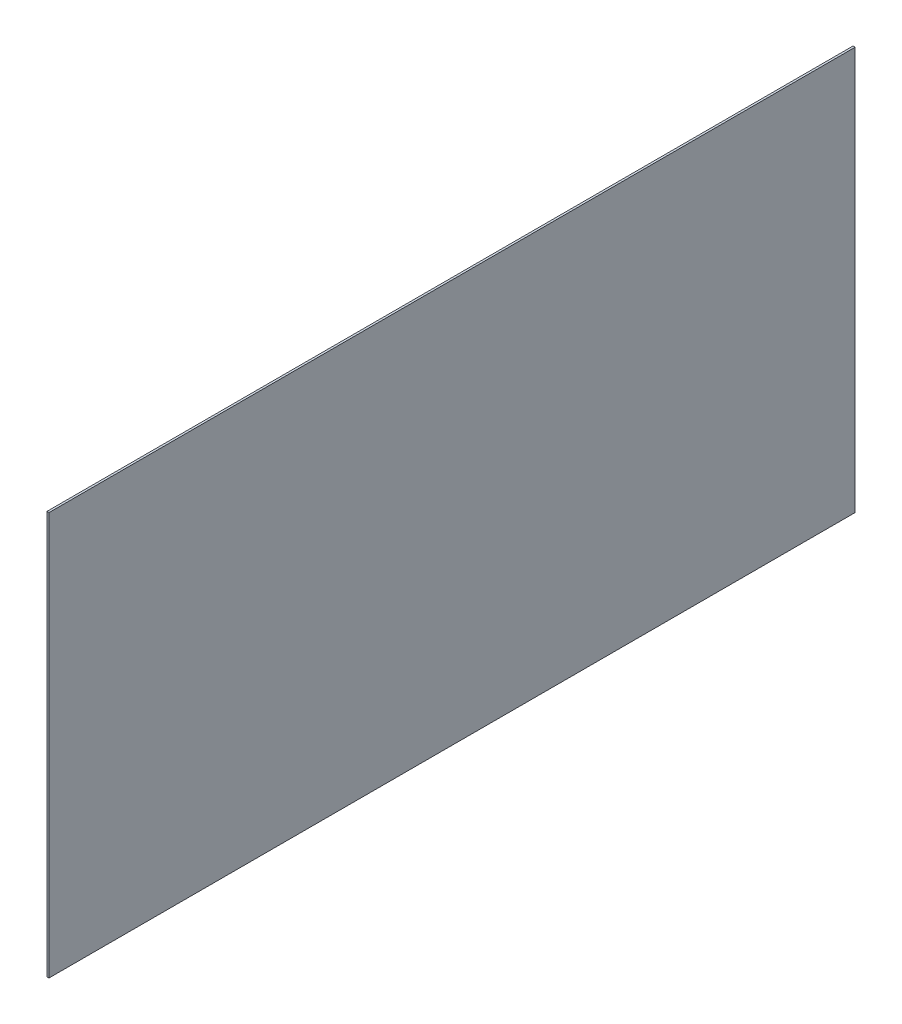
ISO-10303-21;
HEADER;
FILE_DESCRIPTION(('STEP AP214'),'2;1');
FILE_NAME('part.step','',(''),(''),'','','');
FILE_SCHEMA(('AUTOMOTIVE_DESIGN { 1 0 10303 214 1 1 1 1 }'));
ENDSEC;
DATA;
#1=APPLICATION_CONTEXT('core data for automotive mechanical design processes');
#2=APPLICATION_PROTOCOL_DEFINITION('international standard','automotive_design',2000,#1);
#3=PRODUCT_CONTEXT('',#1,'mechanical');
#4=PRODUCT('Part','Part','',(#3));
#5=PRODUCT_RELATED_PRODUCT_CATEGORY('part','',(#4));
#6=PRODUCT_DEFINITION_FORMATION('','',#4);
#7=PRODUCT_DEFINITION_CONTEXT('part definition',#1,'design');
#8=PRODUCT_DEFINITION('design','',#6,#7);
#9=PRODUCT_DEFINITION_SHAPE('','',#8);
#10=(LENGTH_UNIT() NAMED_UNIT(*) SI_UNIT(.MILLI.,.METRE.));
#11=(NAMED_UNIT(*) PLANE_ANGLE_UNIT() SI_UNIT($,.RADIAN.));
#12=(NAMED_UNIT(*) SI_UNIT($,.STERADIAN.) SOLID_ANGLE_UNIT());
#13=UNCERTAINTY_MEASURE_WITH_UNIT(LENGTH_MEASURE(1.E-05),#10,'distance_accuracy_value','');
#14=(GEOMETRIC_REPRESENTATION_CONTEXT(3) GLOBAL_UNCERTAINTY_ASSIGNED_CONTEXT((#13)) GLOBAL_UNIT_ASSIGNED_CONTEXT((#10,
#11,#12)) REPRESENTATION_CONTEXT('',''));
#15=CARTESIAN_POINT('',(0.,0.,0.));
#16=DIRECTION('',(0.,0.,1.));
#17=DIRECTION('',(1.,0.,0.));
#18=AXIS2_PLACEMENT_3D('',#15,#16,#17);
#19=CARTESIAN_POINT('',(4.7625,0.,0.));
#20=DIRECTION('',(0.,0.,-1.));
#21=DIRECTION('',(-1.,0.,0.));
#22=AXIS2_PLACEMENT_3D('',#19,#20,#21);
#23=PLANE('',#22);
#24=DIRECTION('',(0.,-1.,0.));
#25=VECTOR('',#24,1.);
#26=CARTESIAN_POINT('',(0.,0.,0.));
#27=LINE('',#26,#25);
#28=CARTESIAN_POINT('',(0.,914.4,0.));
#29=VERTEX_POINT('',#28);
#30=CARTESIAN_POINT('',(0.,0.,0.));
#31=VERTEX_POINT('',#30);
#32=EDGE_CURVE('E106',#29,#31,#27,.T.);
#33=ORIENTED_EDGE('',*,*,#32,.T.);
#34=DIRECTION('',(-1.,0.,0.));
#35=VECTOR('',#34,1.);
#36=CARTESIAN_POINT('',(4.7625,0.,0.));
#37=LINE('',#36,#35);
#38=CARTESIAN_POINT('',(4.7625,0.,0.));
#39=VERTEX_POINT('',#38);
#40=EDGE_CURVE('E11',#39,#31,#37,.T.);
#41=ORIENTED_EDGE('',*,*,#40,.F.);
#42=DIRECTION('',(0.,-1.,0.));
#43=VECTOR('',#42,1.);
#44=CARTESIAN_POINT('',(4.7625,0.,0.));
#45=LINE('',#44,#43);
#46=CARTESIAN_POINT('',(4.7625,914.4,0.));
#47=VERTEX_POINT('',#46);
#48=EDGE_CURVE('E94',#47,#39,#45,.T.);
#49=ORIENTED_EDGE('',*,*,#48,.F.);
#50=DIRECTION('',(-1.,0.,0.));
#51=VECTOR('',#50,1.);
#52=CARTESIAN_POINT('',(4.7625,914.4,0.));
#53=LINE('',#52,#51);
#54=EDGE_CURVE('E102',#47,#29,#53,.T.);
#55=ORIENTED_EDGE('',*,*,#54,.T.);
#56=EDGE_LOOP('',(#33,#41,#49,#55));
#57=FACE_BOUND('',#56,.T.);
#58=ADVANCED_FACE('F43',(#57),#23,.F.);
#59=CARTESIAN_POINT('',(4.7625,0.,0.));
#60=DIRECTION('',(0.,1.,0.));
#61=DIRECTION('',(0.,0.,1.));
#62=AXIS2_PLACEMENT_3D('',#59,#60,#61);
#63=PLANE('',#62);
#64=DIRECTION('',(0.,0.,-1.));
#65=VECTOR('',#64,1.);
#66=CARTESIAN_POINT('',(0.,0.,0.));
#67=LINE('',#66,#65);
#68=CARTESIAN_POINT('',(0.,0.,-1828.8));
#69=VERTEX_POINT('',#68);
#70=EDGE_CURVE('E98',#31,#69,#67,.T.);
#71=ORIENTED_EDGE('',*,*,#70,.T.);
#72=DIRECTION('',(-1.,0.,0.));
#73=VECTOR('',#72,1.);
#74=CARTESIAN_POINT('',(4.7625,0.,-1828.8));
#75=LINE('',#74,#73);
#76=CARTESIAN_POINT('',(4.7625,0.,-1828.8));
#77=VERTEX_POINT('',#76);
#78=EDGE_CURVE('E51',#77,#69,#75,.T.);
#79=ORIENTED_EDGE('',*,*,#78,.F.);
#80=DIRECTION('',(0.,0.,-1.));
#81=VECTOR('',#80,1.);
#82=CARTESIAN_POINT('',(4.7625,0.,0.));
#83=LINE('',#82,#81);
#84=EDGE_CURVE('E89',#39,#77,#83,.T.);
#85=ORIENTED_EDGE('',*,*,#84,.F.);
#86=ORIENTED_EDGE('',*,*,#40,.T.);
#87=EDGE_LOOP('',(#71,#79,#85,#86));
#88=FACE_BOUND('',#87,.T.);
#89=ADVANCED_FACE('F97',(#88),#63,.F.);
#90=CARTESIAN_POINT('',(4.7625,0.,-1828.8));
#91=DIRECTION('',(0.,0.,1.));
#92=DIRECTION('',(1.,0.,0.));
#93=AXIS2_PLACEMENT_3D('',#90,#91,#92);
#94=PLANE('',#93);
#95=DIRECTION('',(0.,1.,0.));
#96=VECTOR('',#95,1.);
#97=CARTESIAN_POINT('',(0.,0.,-1828.8));
#98=LINE('',#97,#96);
#99=CARTESIAN_POINT('',(0.,914.4,-1828.8));
#100=VERTEX_POINT('',#99);
#101=EDGE_CURVE('E76',#69,#100,#98,.T.);
#102=ORIENTED_EDGE('',*,*,#101,.T.);
#103=DIRECTION('',(-1.,0.,0.));
#104=VECTOR('',#103,1.);
#105=CARTESIAN_POINT('',(4.7625,914.4,-1828.8));
#106=LINE('',#105,#104);
#107=CARTESIAN_POINT('',(4.7625,914.4,-1828.8));
#108=VERTEX_POINT('',#107);
#109=EDGE_CURVE('E99',#108,#100,#106,.T.);
#110=ORIENTED_EDGE('',*,*,#109,.F.);
#111=DIRECTION('',(0.,1.,0.));
#112=VECTOR('',#111,1.);
#113=CARTESIAN_POINT('',(4.7625,0.,-1828.8));
#114=LINE('',#113,#112);
#115=EDGE_CURVE('E92',#77,#108,#114,.T.);
#116=ORIENTED_EDGE('',*,*,#115,.F.);
#117=ORIENTED_EDGE('',*,*,#78,.T.);
#118=EDGE_LOOP('',(#102,#110,#116,#117));
#119=FACE_BOUND('',#118,.T.);
#120=ADVANCED_FACE('F100',(#119),#94,.F.);
#121=CARTESIAN_POINT('',(4.7625,914.4,0.));
#122=DIRECTION('',(0.,-1.,0.));
#123=DIRECTION('',(0.,0.,-1.));
#124=AXIS2_PLACEMENT_3D('',#121,#122,#123);
#125=PLANE('',#124);
#126=DIRECTION('',(0.,0.,1.));
#127=VECTOR('',#126,1.);
#128=CARTESIAN_POINT('',(0.,914.4,0.));
#129=LINE('',#128,#127);
#130=EDGE_CURVE('E82',#100,#29,#129,.T.);
#131=ORIENTED_EDGE('',*,*,#130,.T.);
#132=ORIENTED_EDGE('',*,*,#54,.F.);
#133=DIRECTION('',(0.,0.,1.));
#134=VECTOR('',#133,1.);
#135=CARTESIAN_POINT('',(4.7625,914.4,0.));
#136=LINE('',#135,#134);
#137=EDGE_CURVE('E59',#108,#47,#136,.T.);
#138=ORIENTED_EDGE('',*,*,#137,.F.);
#139=ORIENTED_EDGE('',*,*,#109,.T.);
#140=EDGE_LOOP('',(#131,#132,#138,#139));
#141=FACE_BOUND('',#140,.T.);
#142=ADVANCED_FACE('F113',(#141),#125,.F.);
#143=CARTESIAN_POINT('',(4.7625,0.,0.));
#144=DIRECTION('',(-1.,0.,0.));
#145=DIRECTION('',(0.,0.,1.));
#146=AXIS2_PLACEMENT_3D('',#143,#144,#145);
#147=PLANE('',#146);
#148=ORIENTED_EDGE('',*,*,#48,.T.);
#149=ORIENTED_EDGE('',*,*,#84,.T.);
#150=ORIENTED_EDGE('',*,*,#115,.T.);
#151=ORIENTED_EDGE('',*,*,#137,.T.);
#152=EDGE_LOOP('',(#148,#149,#150,#151));
#153=FACE_BOUND('',#152,.T.);
#154=ADVANCED_FACE('F90',(#153),#147,.F.);
#155=CARTESIAN_POINT('',(0.,0.,0.));
#156=DIRECTION('',(-1.,0.,0.));
#157=DIRECTION('',(0.,0.,1.));
#158=AXIS2_PLACEMENT_3D('',#155,#156,#157);
#159=PLANE('',#158);
#160=ORIENTED_EDGE('',*,*,#32,.F.);
#161=ORIENTED_EDGE('',*,*,#130,.F.);
#162=ORIENTED_EDGE('',*,*,#101,.F.);
#163=ORIENTED_EDGE('',*,*,#70,.F.);
#164=EDGE_LOOP('',(#160,#161,#162,#163));
#165=FACE_BOUND('',#164,.T.);
#166=ADVANCED_FACE('F116',(#165),#159,.T.);
#167=CLOSED_SHELL('',(#58,#89,#120,#142,#154,#166));
#168=MANIFOLD_SOLID_BREP('B2',#167);
#169=ADVANCED_BREP_SHAPE_REPRESENTATION('',(#18,#168),#14);
#170=SHAPE_DEFINITION_REPRESENTATION(#9,#169);
ENDSEC;
END-ISO-10303-21;
